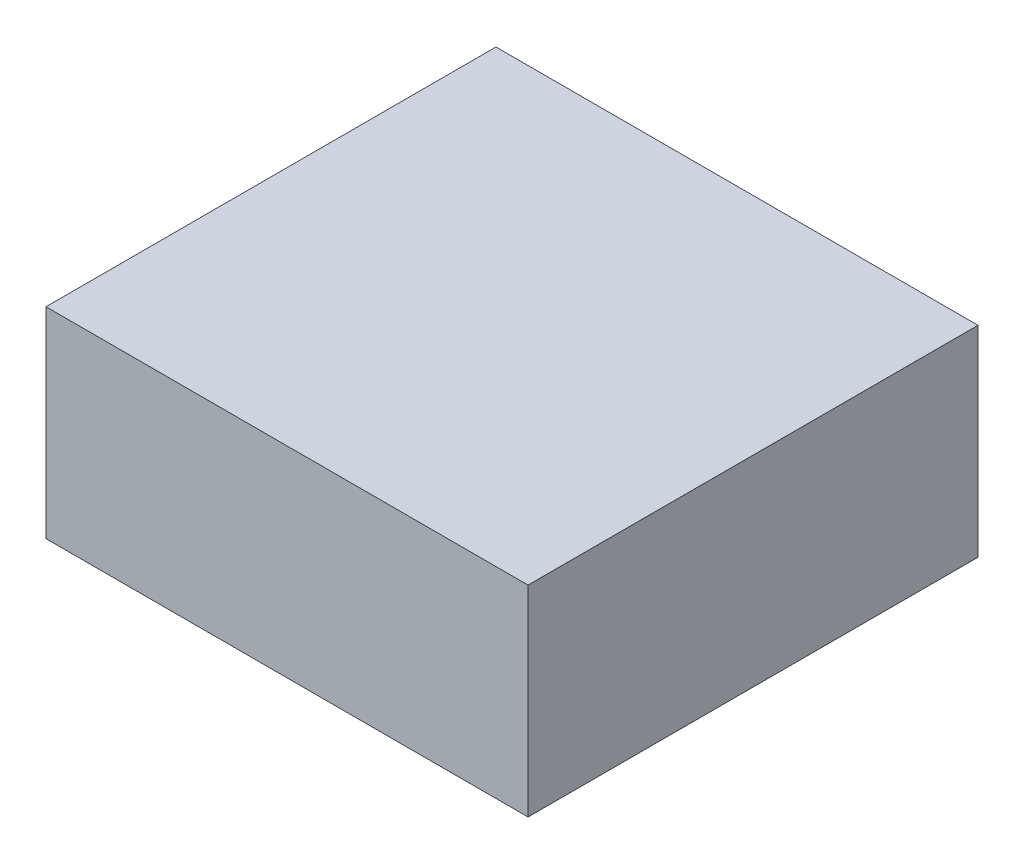
ISO-10303-21;
HEADER;
FILE_DESCRIPTION(('STEP AP214'),'2;1');
FILE_NAME('part.step','',(''),(''),'','','');
FILE_SCHEMA(('AUTOMOTIVE_DESIGN { 1 0 10303 214 1 1 1 1 }'));
ENDSEC;
DATA;
#1=APPLICATION_CONTEXT('core data for automotive mechanical design processes');
#2=APPLICATION_PROTOCOL_DEFINITION('international standard','automotive_design',2000,#1);
#3=PRODUCT_CONTEXT('',#1,'mechanical');
#4=PRODUCT('Part','Part','',(#3));
#5=PRODUCT_RELATED_PRODUCT_CATEGORY('part','',(#4));
#6=PRODUCT_DEFINITION_FORMATION('','',#4);
#7=PRODUCT_DEFINITION_CONTEXT('part definition',#1,'design');
#8=PRODUCT_DEFINITION('design','',#6,#7);
#9=PRODUCT_DEFINITION_SHAPE('','',#8);
#10=(LENGTH_UNIT() NAMED_UNIT(*) SI_UNIT(.MILLI.,.METRE.));
#11=(NAMED_UNIT(*) PLANE_ANGLE_UNIT() SI_UNIT($,.RADIAN.));
#12=(NAMED_UNIT(*) SI_UNIT($,.STERADIAN.) SOLID_ANGLE_UNIT());
#13=UNCERTAINTY_MEASURE_WITH_UNIT(LENGTH_MEASURE(1.E-05),#10,'distance_accuracy_value','');
#14=(GEOMETRIC_REPRESENTATION_CONTEXT(3) GLOBAL_UNCERTAINTY_ASSIGNED_CONTEXT((#13)) GLOBAL_UNIT_ASSIGNED_CONTEXT((#10,
#11,#12)) REPRESENTATION_CONTEXT('',''));
#15=CARTESIAN_POINT('',(0.,0.,0.));
#16=DIRECTION('',(0.,0.,1.));
#17=DIRECTION('',(1.,0.,0.));
#18=AXIS2_PLACEMENT_3D('',#15,#16,#17);
#19=CARTESIAN_POINT('',(0.2999994,0.12500102,0.));
#20=DIRECTION('',(0.,-1.,0.));
#21=DIRECTION('',(0.,0.,-1.));
#22=AXIS2_PLACEMENT_3D('',#19,#20,#21);
#23=PLANE('',#22);
#24=DIRECTION('',(0.,0.,-1.));
#25=VECTOR('',#24,1.);
#26=CARTESIAN_POINT('',(-0.2999994,0.12500102,0.));
#27=LINE('',#26,#25);
#28=CARTESIAN_POINT('',(-0.2999994,0.12500102,0.));
#29=VERTEX_POINT('',#28);
#30=CARTESIAN_POINT('',(-0.2999994,0.12500102,0.55999888));
#31=VERTEX_POINT('',#30);
#32=EDGE_CURVE('E20',#29,#31,#27,.F.);
#33=ORIENTED_EDGE('',*,*,#32,.T.);
#34=DIRECTION('',(-1.,0.,0.));
#35=VECTOR('',#34,1.);
#36=CARTESIAN_POINT('',(-0.2999994,0.12500102,0.55999888));
#37=LINE('',#36,#35);
#38=CARTESIAN_POINT('',(0.2999994,0.12500102,0.55999888));
#39=VERTEX_POINT('',#38);
#40=EDGE_CURVE('E55',#31,#39,#37,.F.);
#41=ORIENTED_EDGE('',*,*,#40,.T.);
#42=DIRECTION('',(0.,0.,1.));
#43=VECTOR('',#42,1.);
#44=CARTESIAN_POINT('',(0.2999994,0.12500102,0.));
#45=LINE('',#44,#43);
#46=CARTESIAN_POINT('',(0.2999994,0.12500102,0.));
#47=VERTEX_POINT('',#46);
#48=EDGE_CURVE('E76',#39,#47,#45,.F.);
#49=ORIENTED_EDGE('',*,*,#48,.T.);
#50=DIRECTION('',(-1.,0.,0.));
#51=VECTOR('',#50,1.);
#52=CARTESIAN_POINT('',(-0.2999994,0.12500102,0.));
#53=LINE('',#52,#51);
#54=EDGE_CURVE('E58',#29,#47,#53,.F.);
#55=ORIENTED_EDGE('',*,*,#54,.F.);
#56=EDGE_LOOP('',(#33,#41,#49,#55));
#57=FACE_BOUND('',#56,.T.);
#58=ADVANCED_FACE('F17',(#57),#23,.F.);
#59=CARTESIAN_POINT('',(-0.2999994,0.12500102,0.));
#60=DIRECTION('',(1.,0.,0.));
#61=DIRECTION('',(0.,0.,-1.));
#62=AXIS2_PLACEMENT_3D('',#59,#60,#61);
#63=PLANE('',#62);
#64=DIRECTION('',(0.,0.,1.));
#65=VECTOR('',#64,1.);
#66=CARTESIAN_POINT('',(-0.2999994,-0.12499848,0.));
#67=LINE('',#66,#65);
#68=CARTESIAN_POINT('',(-0.2999994,-0.12499848,0.));
#69=VERTEX_POINT('',#68);
#70=CARTESIAN_POINT('',(-0.2999994,-0.12499848,0.55999888));
#71=VERTEX_POINT('',#70);
#72=EDGE_CURVE('E73',#69,#71,#67,.T.);
#73=ORIENTED_EDGE('',*,*,#72,.T.);
#74=DIRECTION('',(0.,1.,0.));
#75=VECTOR('',#74,1.);
#76=CARTESIAN_POINT('',(-0.2999994,-0.12499848,0.55999888));
#77=LINE('',#76,#75);
#78=EDGE_CURVE('E63',#71,#31,#77,.T.);
#79=ORIENTED_EDGE('',*,*,#78,.T.);
#80=ORIENTED_EDGE('',*,*,#32,.F.);
#81=DIRECTION('',(0.,1.,0.));
#82=VECTOR('',#81,1.);
#83=CARTESIAN_POINT('',(-0.2999994,-0.12499848,0.));
#84=LINE('',#83,#82);
#85=EDGE_CURVE('E78',#69,#29,#84,.T.);
#86=ORIENTED_EDGE('',*,*,#85,.F.);
#87=EDGE_LOOP('',(#73,#79,#80,#86));
#88=FACE_BOUND('',#87,.T.);
#89=ADVANCED_FACE('F72',(#88),#63,.F.);
#90=CARTESIAN_POINT('',(-0.2999994,-0.12499848,0.55999888));
#91=DIRECTION('',(0.,0.,-1.));
#92=DIRECTION('',(-1.,0.,0.));
#93=AXIS2_PLACEMENT_3D('',#90,#91,#92);
#94=PLANE('',#93);
#95=DIRECTION('',(0.,1.,0.));
#96=VECTOR('',#95,1.);
#97=CARTESIAN_POINT('',(0.2999994,-0.12499848,0.55999888));
#98=LINE('',#97,#96);
#99=CARTESIAN_POINT('',(0.2999994,-0.12499848,0.55999888));
#100=VERTEX_POINT('',#99);
#101=EDGE_CURVE('E69',#100,#39,#98,.T.);
#102=ORIENTED_EDGE('',*,*,#101,.T.);
#103=ORIENTED_EDGE('',*,*,#40,.F.);
#104=ORIENTED_EDGE('',*,*,#78,.F.);
#105=DIRECTION('',(1.,0.,0.));
#106=VECTOR('',#105,1.);
#107=CARTESIAN_POINT('',(-0.2999994,-0.12499848,0.55999888));
#108=LINE('',#107,#106);
#109=EDGE_CURVE('E83',#71,#100,#108,.T.);
#110=ORIENTED_EDGE('',*,*,#109,.T.);
#111=EDGE_LOOP('',(#102,#103,#104,#110));
#112=FACE_BOUND('',#111,.T.);
#113=ADVANCED_FACE('F66',(#112),#94,.F.);
#114=CARTESIAN_POINT('',(0.2999994,-0.12499848,0.));
#115=DIRECTION('',(-1.,0.,0.));
#116=DIRECTION('',(0.,0.,1.));
#117=AXIS2_PLACEMENT_3D('',#114,#115,#116);
#118=PLANE('',#117);
#119=ORIENTED_EDGE('',*,*,#48,.F.);
#120=ORIENTED_EDGE('',*,*,#101,.F.);
#121=DIRECTION('',(0.,0.,1.));
#122=VECTOR('',#121,1.);
#123=CARTESIAN_POINT('',(0.2999994,-0.12499848,0.));
#124=LINE('',#123,#122);
#125=CARTESIAN_POINT('',(0.2999994,-0.12499848,0.));
#126=VERTEX_POINT('',#125);
#127=EDGE_CURVE('E26',#100,#126,#124,.F.);
#128=ORIENTED_EDGE('',*,*,#127,.T.);
#129=DIRECTION('',(0.,1.,0.));
#130=VECTOR('',#129,1.);
#131=CARTESIAN_POINT('',(0.2999994,-0.12499848,0.));
#132=LINE('',#131,#130);
#133=EDGE_CURVE('E34',#47,#126,#132,.F.);
#134=ORIENTED_EDGE('',*,*,#133,.F.);
#135=EDGE_LOOP('',(#119,#120,#128,#134));
#136=FACE_BOUND('',#135,.T.);
#137=ADVANCED_FACE('F88',(#136),#118,.F.);
#138=CARTESIAN_POINT('',(-0.2999994,-0.12499848,0.));
#139=DIRECTION('',(0.,0.,-1.));
#140=DIRECTION('',(-1.,0.,0.));
#141=AXIS2_PLACEMENT_3D('',#138,#139,#140);
#142=PLANE('',#141);
#143=ORIENTED_EDGE('',*,*,#133,.T.);
#144=DIRECTION('',(1.,0.,0.));
#145=VECTOR('',#144,1.);
#146=CARTESIAN_POINT('',(-0.2999994,-0.12499848,0.));
#147=LINE('',#146,#145);
#148=EDGE_CURVE('E11',#126,#69,#147,.F.);
#149=ORIENTED_EDGE('',*,*,#148,.T.);
#150=ORIENTED_EDGE('',*,*,#85,.T.);
#151=ORIENTED_EDGE('',*,*,#54,.T.);
#152=EDGE_LOOP('',(#143,#149,#150,#151));
#153=FACE_BOUND('',#152,.T.);
#154=ADVANCED_FACE('F91',(#153),#142,.T.);
#155=CARTESIAN_POINT('',(-0.2999994,-0.12499848,0.));
#156=DIRECTION('',(0.,1.,0.));
#157=DIRECTION('',(0.,0.,1.));
#158=AXIS2_PLACEMENT_3D('',#155,#156,#157);
#159=PLANE('',#158);
#160=ORIENTED_EDGE('',*,*,#127,.F.);
#161=ORIENTED_EDGE('',*,*,#109,.F.);
#162=ORIENTED_EDGE('',*,*,#72,.F.);
#163=ORIENTED_EDGE('',*,*,#148,.F.);
#164=EDGE_LOOP('',(#160,#161,#162,#163));
#165=FACE_BOUND('',#164,.T.);
#166=ADVANCED_FACE('F90',(#165),#159,.F.);
#167=CLOSED_SHELL('',(#58,#89,#113,#137,#154,#166));
#168=MANIFOLD_SOLID_BREP('B1',#167);
#169=ADVANCED_BREP_SHAPE_REPRESENTATION('',(#18,#168),#14);
#170=SHAPE_DEFINITION_REPRESENTATION(#9,#169);
ENDSEC;
END-ISO-10303-21;
